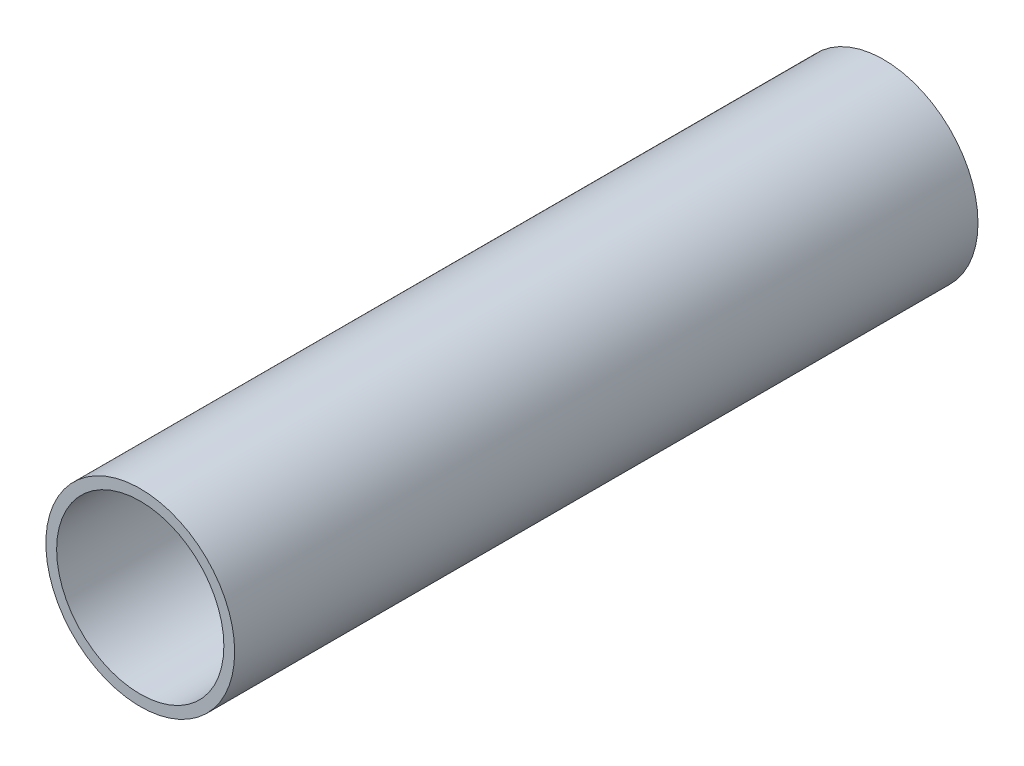
ISO-10303-21;
HEADER;
FILE_DESCRIPTION(('STEP AP214'),'2;1');
FILE_NAME('part.step','',(''),(''),'','','');
FILE_SCHEMA(('AUTOMOTIVE_DESIGN { 1 0 10303 214 1 1 1 1 }'));
ENDSEC;
DATA;
#1=APPLICATION_CONTEXT('core data for automotive mechanical design processes');
#2=APPLICATION_PROTOCOL_DEFINITION('international standard','automotive_design',2000,#1);
#3=PRODUCT_CONTEXT('',#1,'mechanical');
#4=PRODUCT('Part','Part','',(#3));
#5=PRODUCT_RELATED_PRODUCT_CATEGORY('part','',(#4));
#6=PRODUCT_DEFINITION_FORMATION('','',#4);
#7=PRODUCT_DEFINITION_CONTEXT('part definition',#1,'design');
#8=PRODUCT_DEFINITION('design','',#6,#7);
#9=PRODUCT_DEFINITION_SHAPE('','',#8);
#10=(LENGTH_UNIT() NAMED_UNIT(*) SI_UNIT(.MILLI.,.METRE.));
#11=(NAMED_UNIT(*) PLANE_ANGLE_UNIT() SI_UNIT($,.RADIAN.));
#12=(NAMED_UNIT(*) SI_UNIT($,.STERADIAN.) SOLID_ANGLE_UNIT());
#13=UNCERTAINTY_MEASURE_WITH_UNIT(LENGTH_MEASURE(1.E-05),#10,'distance_accuracy_value','');
#14=(GEOMETRIC_REPRESENTATION_CONTEXT(3) GLOBAL_UNCERTAINTY_ASSIGNED_CONTEXT((#13)) GLOBAL_UNIT_ASSIGNED_CONTEXT((#10,
#11,#12)) REPRESENTATION_CONTEXT('',''));
#15=CARTESIAN_POINT('',(0.,0.,0.));
#16=DIRECTION('',(0.,0.,1.));
#17=DIRECTION('',(1.,0.,0.));
#18=AXIS2_PLACEMENT_3D('',#15,#16,#17);
#19=CARTESIAN_POINT('',(0.,0.,0.));
#20=DIRECTION('',(0.,0.,1.));
#21=DIRECTION('',(1.,0.,0.));
#22=AXIS2_PLACEMENT_3D('',#19,#20,#21);
#23=CYLINDRICAL_SURFACE('',#22,45.);
#24=CARTESIAN_POINT('',(0.,0.,400.));
#25=DIRECTION('',(0.,0.,1.));
#26=DIRECTION('',(1.,0.,0.));
#27=AXIS2_PLACEMENT_3D('',#24,#25,#26);
#28=CIRCLE('',#27,45.);
#29=CARTESIAN_POINT('',(45.,0.,400.));
#30=VERTEX_POINT('',#29);
#31=EDGE_CURVE('E17',#30,#30,#28,.F.);
#32=ORIENTED_EDGE('',*,*,#31,.F.);
#33=EDGE_LOOP('',(#32));
#34=FACE_BOUND('',#33,.T.);
#35=CARTESIAN_POINT('',(0.,0.,0.));
#36=DIRECTION('',(0.,0.,1.));
#37=DIRECTION('',(1.,0.,0.));
#38=AXIS2_PLACEMENT_3D('',#35,#36,#37);
#39=CIRCLE('',#38,45.);
#40=CARTESIAN_POINT('',(45.,0.,0.));
#41=VERTEX_POINT('',#40);
#42=EDGE_CURVE('E26',#41,#41,#39,.F.);
#43=ORIENTED_EDGE('',*,*,#42,.T.);
#44=EDGE_LOOP('',(#43));
#45=FACE_BOUND('',#44,.T.);
#46=ADVANCED_FACE('F14',(#34,#45),#23,.F.);
#47=CARTESIAN_POINT('',(0.,0.,400.));
#48=DIRECTION('',(0.,0.,1.));
#49=DIRECTION('',(1.,0.,0.));
#50=AXIS2_PLACEMENT_3D('',#47,#48,#49);
#51=PLANE('',#50);
#52=ORIENTED_EDGE('',*,*,#31,.T.);
#53=EDGE_LOOP('',(#52));
#54=FACE_BOUND('',#53,.T.);
#55=CARTESIAN_POINT('',(0.,0.,400.));
#56=DIRECTION('',(0.,0.,1.));
#57=DIRECTION('',(1.,0.,0.));
#58=AXIS2_PLACEMENT_3D('',#55,#56,#57);
#59=CIRCLE('',#58,50.8);
#60=CARTESIAN_POINT('',(50.8,0.,400.));
#61=VERTEX_POINT('',#60);
#62=EDGE_CURVE('E21',#61,#61,#59,.F.);
#63=ORIENTED_EDGE('',*,*,#62,.F.);
#64=EDGE_LOOP('',(#63));
#65=FACE_BOUND('',#64,.T.);
#66=ADVANCED_FACE('F34',(#54,#65),#51,.T.);
#67=CARTESIAN_POINT('',(0.,0.,0.));
#68=DIRECTION('',(0.,0.,1.));
#69=DIRECTION('',(1.,0.,0.));
#70=AXIS2_PLACEMENT_3D('',#67,#68,#69);
#71=PLANE('',#70);
#72=ORIENTED_EDGE('',*,*,#42,.F.);
#73=EDGE_LOOP('',(#72));
#74=FACE_BOUND('',#73,.T.);
#75=CARTESIAN_POINT('',(0.,0.,0.));
#76=DIRECTION('',(0.,0.,1.));
#77=DIRECTION('',(1.,0.,0.));
#78=AXIS2_PLACEMENT_3D('',#75,#76,#77);
#79=CIRCLE('',#78,50.8);
#80=CARTESIAN_POINT('',(50.8,0.,0.));
#81=VERTEX_POINT('',#80);
#82=EDGE_CURVE('E9',#81,#81,#79,.T.);
#83=ORIENTED_EDGE('',*,*,#82,.F.);
#84=EDGE_LOOP('',(#83));
#85=FACE_BOUND('',#84,.T.);
#86=ADVANCED_FACE('F42',(#74,#85),#71,.F.);
#87=CARTESIAN_POINT('',(0.,0.,0.));
#88=DIRECTION('',(0.,0.,1.));
#89=DIRECTION('',(1.,0.,0.));
#90=AXIS2_PLACEMENT_3D('',#87,#88,#89);
#91=CYLINDRICAL_SURFACE('',#90,50.8);
#92=ORIENTED_EDGE('',*,*,#62,.T.);
#93=EDGE_LOOP('',(#92));
#94=FACE_BOUND('',#93,.T.);
#95=ORIENTED_EDGE('',*,*,#82,.T.);
#96=EDGE_LOOP('',(#95));
#97=FACE_BOUND('',#96,.T.);
#98=ADVANCED_FACE('F43',(#94,#97),#91,.T.);
#99=CLOSED_SHELL('',(#46,#66,#86,#98));
#100=MANIFOLD_SOLID_BREP('B1',#99);
#101=ADVANCED_BREP_SHAPE_REPRESENTATION('',(#18,#100),#14);
#102=SHAPE_DEFINITION_REPRESENTATION(#9,#101);
ENDSEC;
END-ISO-10303-21;
